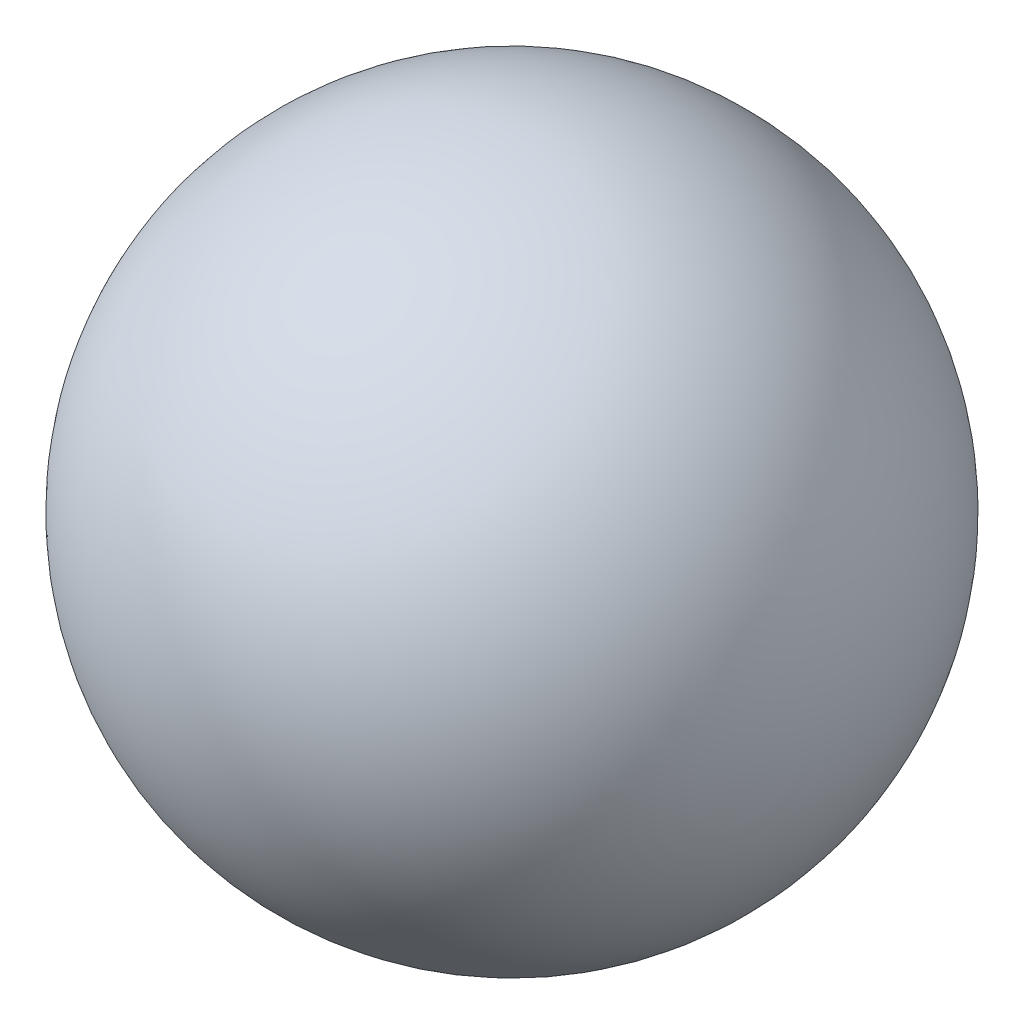
ISO-10303-21;
HEADER;
FILE_DESCRIPTION(('STEP AP214'),'2;1');
FILE_NAME('part.step','',(''),(''),'','','');
FILE_SCHEMA(('AUTOMOTIVE_DESIGN { 1 0 10303 214 1 1 1 1 }'));
ENDSEC;
DATA;
#1=APPLICATION_CONTEXT('core data for automotive mechanical design processes');
#2=APPLICATION_PROTOCOL_DEFINITION('international standard','automotive_design',2000,#1);
#3=PRODUCT_CONTEXT('',#1,'mechanical');
#4=PRODUCT('Part','Part','',(#3));
#5=PRODUCT_RELATED_PRODUCT_CATEGORY('part','',(#4));
#6=PRODUCT_DEFINITION_FORMATION('','',#4);
#7=PRODUCT_DEFINITION_CONTEXT('part definition',#1,'design');
#8=PRODUCT_DEFINITION('design','',#6,#7);
#9=PRODUCT_DEFINITION_SHAPE('','',#8);
#10=(LENGTH_UNIT() NAMED_UNIT(*) SI_UNIT(.MILLI.,.METRE.));
#11=(NAMED_UNIT(*) PLANE_ANGLE_UNIT() SI_UNIT($,.RADIAN.));
#12=(NAMED_UNIT(*) SI_UNIT($,.STERADIAN.) SOLID_ANGLE_UNIT());
#13=UNCERTAINTY_MEASURE_WITH_UNIT(LENGTH_MEASURE(1.E-05),#10,'distance_accuracy_value','');
#14=(GEOMETRIC_REPRESENTATION_CONTEXT(3) GLOBAL_UNCERTAINTY_ASSIGNED_CONTEXT((#13)) GLOBAL_UNIT_ASSIGNED_CONTEXT((#10,
#11,#12)) REPRESENTATION_CONTEXT('',''));
#15=CARTESIAN_POINT('',(0.,0.,0.));
#16=DIRECTION('',(0.,0.,1.));
#17=DIRECTION('',(1.,0.,0.));
#18=AXIS2_PLACEMENT_3D('',#15,#16,#17);
#19=CARTESIAN_POINT('',(0.,0.,0.));
#20=DIRECTION('',(-1.,0.,0.));
#21=DIRECTION('',(0.,1.,0.));
#22=AXIS2_PLACEMENT_3D('',#19,#20,#21);
#23=SPHERICAL_SURFACE('',#22,1.44);
#24=CARTESIAN_POINT('',(-1.44,0.,0.));
#25=VERTEX_POINT('',#24);
#26=VERTEX_LOOP('',#25);
#27=FACE_BOUND('',#26,.T.);
#28=ADVANCED_FACE('F38',(#27),#23,.T.);
#29=CLOSED_SHELL('',(#28));
#30=MANIFOLD_SOLID_BREP('B2',#29);
#31=ADVANCED_BREP_SHAPE_REPRESENTATION('',(#18,#30),#14);
#32=SHAPE_DEFINITION_REPRESENTATION(#9,#31);
ENDSEC;
END-ISO-10303-21;
